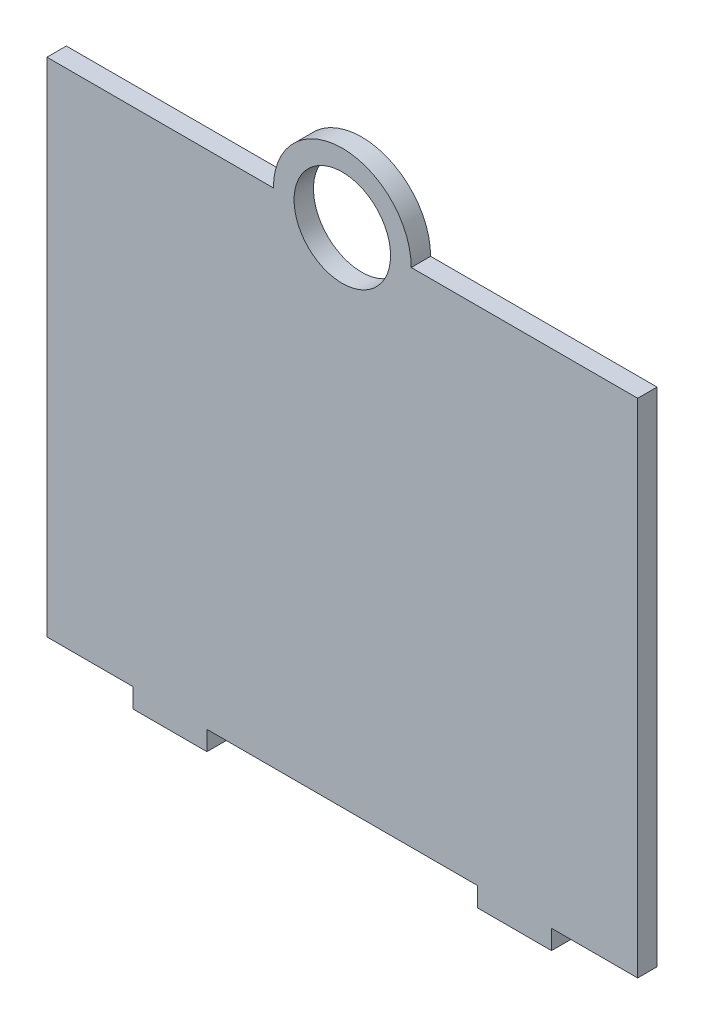
ISO-10303-21;
HEADER;
FILE_DESCRIPTION(('STEP AP214'),'2;1');
FILE_NAME('part.step','',(''),(''),'','','');
FILE_SCHEMA(('AUTOMOTIVE_DESIGN { 1 0 10303 214 1 1 1 1 }'));
ENDSEC;
DATA;
#1=APPLICATION_CONTEXT('core data for automotive mechanical design processes');
#2=APPLICATION_PROTOCOL_DEFINITION('international standard','automotive_design',2000,#1);
#3=PRODUCT_CONTEXT('',#1,'mechanical');
#4=PRODUCT('Part','Part','',(#3));
#5=PRODUCT_RELATED_PRODUCT_CATEGORY('part','',(#4));
#6=PRODUCT_DEFINITION_FORMATION('','',#4);
#7=PRODUCT_DEFINITION_CONTEXT('part definition',#1,'design');
#8=PRODUCT_DEFINITION('design','',#6,#7);
#9=PRODUCT_DEFINITION_SHAPE('','',#8);
#10=(LENGTH_UNIT() NAMED_UNIT(*) SI_UNIT(.MILLI.,.METRE.));
#11=(NAMED_UNIT(*) PLANE_ANGLE_UNIT() SI_UNIT($,.RADIAN.));
#12=(NAMED_UNIT(*) SI_UNIT($,.STERADIAN.) SOLID_ANGLE_UNIT());
#13=UNCERTAINTY_MEASURE_WITH_UNIT(LENGTH_MEASURE(1.E-05),#10,'distance_accuracy_value','');
#14=(GEOMETRIC_REPRESENTATION_CONTEXT(3) GLOBAL_UNCERTAINTY_ASSIGNED_CONTEXT((#13)) GLOBAL_UNIT_ASSIGNED_CONTEXT((#10,
#11,#12)) REPRESENTATION_CONTEXT('',''));
#15=CARTESIAN_POINT('',(0.,0.,0.));
#16=DIRECTION('',(0.,0.,1.));
#17=DIRECTION('',(1.,0.,0.));
#18=AXIS2_PLACEMENT_3D('',#15,#16,#17);
#19=CARTESIAN_POINT('',(0.,142.24,0.));
#20=DIRECTION('',(0.,0.,1.));
#21=DIRECTION('',(1.,0.,0.));
#22=AXIS2_PLACEMENT_3D('',#19,#20,#21);
#23=PLANE('',#22);
#24=CARTESIAN_POINT('',(0.,142.24,0.));
#25=DIRECTION('',(0.,0.,1.));
#26=DIRECTION('',(1.,0.,0.));
#27=AXIS2_PLACEMENT_3D('',#24,#25,#26);
#28=CIRCLE('',#27,12.446);
#29=CARTESIAN_POINT('',(12.446,142.24,0.));
#30=VERTEX_POINT('',#29);
#31=EDGE_CURVE('E19',#30,#30,#28,.F.);
#32=ORIENTED_EDGE('',*,*,#31,.T.);
#33=EDGE_LOOP('',(#32));
#34=FACE_BOUND('',#33,.T.);
#35=DIRECTION('',(1.,0.,0.));
#36=VECTOR('',#35,1.);
#37=CARTESIAN_POINT('',(-34.925,12.7,0.));
#38=LINE('',#37,#36);
#39=CARTESIAN_POINT('',(34.925,12.7,0.));
#40=VERTEX_POINT('',#39);
#41=CARTESIAN_POINT('',(-34.925,12.7,0.));
#42=VERTEX_POINT('',#41);
#43=EDGE_CURVE('E458',#40,#42,#38,.F.);
#44=ORIENTED_EDGE('',*,*,#43,.F.);
#45=DIRECTION('',(0.,1.,0.));
#46=VECTOR('',#45,1.);
#47=CARTESIAN_POINT('',(34.925,0.,0.));
#48=LINE('',#47,#46);
#49=CARTESIAN_POINT('',(34.925,7.6999999999999,0.));
#50=VERTEX_POINT('',#49);
#51=EDGE_CURVE('E454',#50,#40,#48,.T.);
#52=ORIENTED_EDGE('',*,*,#51,.F.);
#53=DIRECTION('',(1.,0.,0.));
#54=VECTOR('',#53,1.);
#55=CARTESIAN_POINT('',(-53.975,7.6999999999999,0.));
#56=LINE('',#55,#54);
#57=CARTESIAN_POINT('',(53.975,7.6999999999999,0.));
#58=VERTEX_POINT('',#57);
#59=EDGE_CURVE('E441',#50,#58,#56,.T.);
#60=ORIENTED_EDGE('',*,*,#59,.T.);
#61=DIRECTION('',(0.,1.,0.));
#62=VECTOR('',#61,1.);
#63=CARTESIAN_POINT('',(53.975,0.,0.));
#64=LINE('',#63,#62);
#65=CARTESIAN_POINT('',(53.975,12.7,0.));
#66=VERTEX_POINT('',#65);
#67=EDGE_CURVE('E168',#66,#58,#64,.F.);
#68=ORIENTED_EDGE('',*,*,#67,.F.);
#69=DIRECTION('',(1.,0.,0.));
#70=VECTOR('',#69,1.);
#71=CARTESIAN_POINT('',(53.975,12.7,0.));
#72=LINE('',#71,#70);
#73=CARTESIAN_POINT('',(76.2,12.7,0.));
#74=VERTEX_POINT('',#73);
#75=EDGE_CURVE('E173',#74,#66,#72,.F.);
#76=ORIENTED_EDGE('',*,*,#75,.F.);
#77=DIRECTION('',(0.,1.,0.));
#78=VECTOR('',#77,1.);
#79=CARTESIAN_POINT('',(76.2000000000016,142.24,0.));
#80=LINE('',#79,#78);
#81=CARTESIAN_POINT('',(76.2000000000016,142.24,0.));
#82=VERTEX_POINT('',#81);
#83=EDGE_CURVE('E133',#82,#74,#80,.F.);
#84=ORIENTED_EDGE('',*,*,#83,.F.);
#85=DIRECTION('',(1.,0.,0.));
#86=VECTOR('',#85,1.);
#87=CARTESIAN_POINT('',(17.7800000000008,142.24,0.));
#88=LINE('',#87,#86);
#89=CARTESIAN_POINT('',(17.7800000000008,142.24,0.));
#90=VERTEX_POINT('',#89);
#91=EDGE_CURVE('E130',#90,#82,#88,.T.);
#92=ORIENTED_EDGE('',*,*,#91,.F.);
#93=CARTESIAN_POINT('',(0.,142.24,0.));
#94=DIRECTION('',(0.,0.,1.));
#95=DIRECTION('',(1.,0.,0.));
#96=AXIS2_PLACEMENT_3D('',#93,#94,#95);
#97=CIRCLE('',#96,17.7800000000008);
#98=CARTESIAN_POINT('',(-17.7800000000008,142.24,0.));
#99=VERTEX_POINT('',#98);
#100=EDGE_CURVE('E119',#99,#90,#97,.F.);
#101=ORIENTED_EDGE('',*,*,#100,.F.);
#102=DIRECTION('',(1.,0.,0.));
#103=VECTOR('',#102,1.);
#104=CARTESIAN_POINT('',(-76.2000000000008,142.24,0.));
#105=LINE('',#104,#103);
#106=CARTESIAN_POINT('',(-76.2000000000008,142.24,0.));
#107=VERTEX_POINT('',#106);
#108=EDGE_CURVE('E114',#107,#99,#105,.T.);
#109=ORIENTED_EDGE('',*,*,#108,.F.);
#110=DIRECTION('',(0.,-1.,0.));
#111=VECTOR('',#110,1.);
#112=CARTESIAN_POINT('',(-76.2000000000008,142.24,0.));
#113=LINE('',#112,#111);
#114=CARTESIAN_POINT('',(-76.2,12.7,0.));
#115=VERTEX_POINT('',#114);
#116=EDGE_CURVE('E182',#115,#107,#113,.F.);
#117=ORIENTED_EDGE('',*,*,#116,.F.);
#118=DIRECTION('',(1.,0.,0.));
#119=VECTOR('',#118,1.);
#120=CARTESIAN_POINT('',(-76.2,12.7,0.));
#121=LINE('',#120,#119);
#122=CARTESIAN_POINT('',(-53.975,12.7,0.));
#123=VERTEX_POINT('',#122);
#124=EDGE_CURVE('E187',#123,#115,#121,.F.);
#125=ORIENTED_EDGE('',*,*,#124,.F.);
#126=DIRECTION('',(0.,1.,0.));
#127=VECTOR('',#126,1.);
#128=CARTESIAN_POINT('',(-53.975,0.,0.));
#129=LINE('',#128,#127);
#130=CARTESIAN_POINT('',(-53.975,7.6999999999999,0.));
#131=VERTEX_POINT('',#130);
#132=EDGE_CURVE('E193',#131,#123,#129,.T.);
#133=ORIENTED_EDGE('',*,*,#132,.F.);
#134=DIRECTION('',(1.,0.,0.));
#135=VECTOR('',#134,1.);
#136=CARTESIAN_POINT('',(-53.975,7.6999999999999,0.));
#137=LINE('',#136,#135);
#138=CARTESIAN_POINT('',(-34.925,7.6999999999999,0.));
#139=VERTEX_POINT('',#138);
#140=EDGE_CURVE('E465',#131,#139,#137,.T.);
#141=ORIENTED_EDGE('',*,*,#140,.T.);
#142=DIRECTION('',(0.,1.,0.));
#143=VECTOR('',#142,1.);
#144=CARTESIAN_POINT('',(-34.925,0.,0.));
#145=LINE('',#144,#143);
#146=EDGE_CURVE('E460',#42,#139,#145,.F.);
#147=ORIENTED_EDGE('',*,*,#146,.F.);
#148=EDGE_LOOP('',(#44,#52,#60,#68,#76,#84,#92,#101,#109,#117,#125,#133,#141,#147));
#149=FACE_BOUND('',#148,.T.);
#150=ADVANCED_FACE('F16',(#34,#149),#23,.T.);
#151=CARTESIAN_POINT('',(0.,142.24,-5.));
#152=DIRECTION('',(0.,0.,1.));
#153=DIRECTION('',(1.,0.,0.));
#154=AXIS2_PLACEMENT_3D('',#151,#152,#153);
#155=CYLINDRICAL_SURFACE('',#154,12.446);
#156=CARTESIAN_POINT('',(0.,142.24,-5.));
#157=DIRECTION('',(0.,0.,1.));
#158=DIRECTION('',(1.,0.,0.));
#159=AXIS2_PLACEMENT_3D('',#156,#157,#158);
#160=CIRCLE('',#159,12.446);
#161=CARTESIAN_POINT('',(12.446,142.24,-5.));
#162=VERTEX_POINT('',#161);
#163=EDGE_CURVE('E162',#162,#162,#160,.F.);
#164=ORIENTED_EDGE('',*,*,#163,.T.);
#165=EDGE_LOOP('',(#164));
#166=FACE_BOUND('',#165,.T.);
#167=ORIENTED_EDGE('',*,*,#31,.F.);
#168=EDGE_LOOP('',(#167));
#169=FACE_BOUND('',#168,.T.);
#170=ADVANCED_FACE('F207',(#166,#169),#155,.F.);
#171=CARTESIAN_POINT('',(53.975,12.7,-5.));
#172=DIRECTION('',(0.,-1.,0.));
#173=DIRECTION('',(0.,0.,-1.));
#174=AXIS2_PLACEMENT_3D('',#171,#172,#173);
#175=PLANE('',#174);
#176=DIRECTION('',(1.,0.,0.));
#177=VECTOR('',#176,1.);
#178=CARTESIAN_POINT('',(0.,12.7,-5.));
#179=LINE('',#178,#177);
#180=CARTESIAN_POINT('',(53.9750000000008,12.7,-5.));
#181=VERTEX_POINT('',#180);
#182=CARTESIAN_POINT('',(76.2,12.7,-5.));
#183=VERTEX_POINT('',#182);
#184=EDGE_CURVE('E154',#181,#183,#179,.T.);
#185=ORIENTED_EDGE('',*,*,#184,.T.);
#186=DIRECTION('',(0.,0.,1.));
#187=VECTOR('',#186,1.);
#188=CARTESIAN_POINT('',(76.2,12.7,-5.));
#189=LINE('',#188,#187);
#190=EDGE_CURVE('E136',#74,#183,#189,.F.);
#191=ORIENTED_EDGE('',*,*,#190,.F.);
#192=ORIENTED_EDGE('',*,*,#75,.T.);
#193=DIRECTION('',(0.,0.,-1.));
#194=VECTOR('',#193,1.);
#195=CARTESIAN_POINT('',(53.975,12.7,-5.));
#196=LINE('',#195,#194);
#197=EDGE_CURVE('E165',#181,#66,#196,.F.);
#198=ORIENTED_EDGE('',*,*,#197,.F.);
#199=EDGE_LOOP('',(#185,#191,#192,#198));
#200=FACE_BOUND('',#199,.T.);
#201=ADVANCED_FACE('F265',(#200),#175,.T.);
#202=CARTESIAN_POINT('',(76.2000000000016,142.24,-5.));
#203=DIRECTION('',(1.,0.,0.));
#204=DIRECTION('',(0.,1.,0.));
#205=AXIS2_PLACEMENT_3D('',#202,#203,#204);
#206=PLANE('',#205);
#207=DIRECTION('',(0.,1.,0.));
#208=VECTOR('',#207,1.);
#209=CARTESIAN_POINT('',(76.2,142.24,-5.));
#210=LINE('',#209,#208);
#211=CARTESIAN_POINT('',(76.2000000000006,142.24,-5.));
#212=VERTEX_POINT('',#211);
#213=EDGE_CURVE('E151',#183,#212,#210,.T.);
#214=ORIENTED_EDGE('',*,*,#213,.T.);
#215=DIRECTION('',(0.,0.,1.));
#216=VECTOR('',#215,1.);
#217=CARTESIAN_POINT('',(76.2000000000016,142.24,-5.));
#218=LINE('',#217,#216);
#219=EDGE_CURVE('E128',#82,#212,#218,.F.);
#220=ORIENTED_EDGE('',*,*,#219,.F.);
#221=ORIENTED_EDGE('',*,*,#83,.T.);
#222=ORIENTED_EDGE('',*,*,#190,.T.);
#223=EDGE_LOOP('',(#214,#220,#221,#222));
#224=FACE_BOUND('',#223,.T.);
#225=ADVANCED_FACE('F262',(#224),#206,.T.);
#226=CARTESIAN_POINT('',(17.7800000000008,142.24,-5.));
#227=DIRECTION('',(0.,1.,0.));
#228=DIRECTION('',(0.,0.,1.));
#229=AXIS2_PLACEMENT_3D('',#226,#227,#228);
#230=PLANE('',#229);
#231=DIRECTION('',(1.,0.,0.));
#232=VECTOR('',#231,1.);
#233=CARTESIAN_POINT('',(0.,142.24,-5.));
#234=LINE('',#233,#232);
#235=CARTESIAN_POINT('',(17.7800000000008,142.24,-5.));
#236=VERTEX_POINT('',#235);
#237=EDGE_CURVE('E141',#212,#236,#234,.F.);
#238=ORIENTED_EDGE('',*,*,#237,.T.);
#239=DIRECTION('',(0.,0.,1.));
#240=VECTOR('',#239,1.);
#241=CARTESIAN_POINT('',(17.7800000000008,142.24,-5.));
#242=LINE('',#241,#240);
#243=EDGE_CURVE('E124',#90,#236,#242,.F.);
#244=ORIENTED_EDGE('',*,*,#243,.F.);
#245=ORIENTED_EDGE('',*,*,#91,.T.);
#246=ORIENTED_EDGE('',*,*,#219,.T.);
#247=EDGE_LOOP('',(#238,#244,#245,#246));
#248=FACE_BOUND('',#247,.T.);
#249=ADVANCED_FACE('F139',(#248),#230,.T.);
#250=CARTESIAN_POINT('',(0.,142.24,-5.));
#251=DIRECTION('',(0.,0.,1.));
#252=DIRECTION('',(1.,0.,0.));
#253=AXIS2_PLACEMENT_3D('',#250,#251,#252);
#254=CYLINDRICAL_SURFACE('',#253,17.7800000000008);
#255=CARTESIAN_POINT('',(0.,142.24,-5.));
#256=DIRECTION('',(0.,0.,1.));
#257=DIRECTION('',(1.,0.,0.));
#258=AXIS2_PLACEMENT_3D('',#255,#256,#257);
#259=CIRCLE('',#258,17.7800000000008);
#260=CARTESIAN_POINT('',(-17.7800000000008,142.24,-5.));
#261=VERTEX_POINT('',#260);
#262=EDGE_CURVE('E201',#236,#261,#259,.T.);
#263=ORIENTED_EDGE('',*,*,#262,.T.);
#264=DIRECTION('',(0.,0.,1.));
#265=VECTOR('',#264,1.);
#266=CARTESIAN_POINT('',(-17.7800000000008,142.24,-5.));
#267=LINE('',#266,#265);
#268=EDGE_CURVE('E126',#99,#261,#267,.F.);
#269=ORIENTED_EDGE('',*,*,#268,.F.);
#270=ORIENTED_EDGE('',*,*,#100,.T.);
#271=ORIENTED_EDGE('',*,*,#243,.T.);
#272=EDGE_LOOP('',(#263,#269,#270,#271));
#273=FACE_BOUND('',#272,.T.);
#274=ADVANCED_FACE('F122',(#273),#254,.T.);
#275=CARTESIAN_POINT('',(-76.2000000000008,142.24,-5.));
#276=DIRECTION('',(0.,1.,0.));
#277=DIRECTION('',(0.,0.,1.));
#278=AXIS2_PLACEMENT_3D('',#275,#276,#277);
#279=PLANE('',#278);
#280=DIRECTION('',(1.,0.,0.));
#281=VECTOR('',#280,1.);
#282=CARTESIAN_POINT('',(0.,142.24,-5.));
#283=LINE('',#282,#281);
#284=CARTESIAN_POINT('',(-76.2000000000008,142.24,-5.));
#285=VERTEX_POINT('',#284);
#286=EDGE_CURVE('E203',#261,#285,#283,.F.);
#287=ORIENTED_EDGE('',*,*,#286,.T.);
#288=DIRECTION('',(0.,0.,1.));
#289=VECTOR('',#288,1.);
#290=CARTESIAN_POINT('',(-76.2000000000008,142.24,-5.));
#291=LINE('',#290,#289);
#292=EDGE_CURVE('E184',#107,#285,#291,.F.);
#293=ORIENTED_EDGE('',*,*,#292,.F.);
#294=ORIENTED_EDGE('',*,*,#108,.T.);
#295=ORIENTED_EDGE('',*,*,#268,.T.);
#296=EDGE_LOOP('',(#287,#293,#294,#295));
#297=FACE_BOUND('',#296,.T.);
#298=ADVANCED_FACE('F254',(#297),#279,.T.);
#299=CARTESIAN_POINT('',(-76.2000000000008,142.24,-5.));
#300=DIRECTION('',(-1.,0.,0.));
#301=DIRECTION('',(0.,-1.,0.));
#302=AXIS2_PLACEMENT_3D('',#299,#300,#301);
#303=PLANE('',#302);
#304=DIRECTION('',(0.,1.,0.));
#305=VECTOR('',#304,1.);
#306=CARTESIAN_POINT('',(-76.2000000000008,142.24,-5.));
#307=LINE('',#306,#305);
#308=CARTESIAN_POINT('',(-76.2000000000002,12.7,-5.));
#309=VERTEX_POINT('',#308);
#310=EDGE_CURVE('E474',#285,#309,#307,.F.);
#311=ORIENTED_EDGE('',*,*,#310,.T.);
#312=DIRECTION('',(0.,0.,-1.));
#313=VECTOR('',#312,1.);
#314=CARTESIAN_POINT('',(-76.2,12.7,-5.));
#315=LINE('',#314,#313);
#316=EDGE_CURVE('E189',#115,#309,#315,.T.);
#317=ORIENTED_EDGE('',*,*,#316,.F.);
#318=ORIENTED_EDGE('',*,*,#116,.T.);
#319=ORIENTED_EDGE('',*,*,#292,.T.);
#320=EDGE_LOOP('',(#311,#317,#318,#319));
#321=FACE_BOUND('',#320,.T.);
#322=ADVANCED_FACE('F250',(#321),#303,.T.);
#323=CARTESIAN_POINT('',(-76.2,12.7,-5.));
#324=DIRECTION('',(0.,-1.,0.));
#325=DIRECTION('',(0.,0.,-1.));
#326=AXIS2_PLACEMENT_3D('',#323,#324,#325);
#327=PLANE('',#326);
#328=DIRECTION('',(1.,0.,0.));
#329=VECTOR('',#328,1.);
#330=CARTESIAN_POINT('',(0.,12.7,-5.));
#331=LINE('',#330,#329);
#332=CARTESIAN_POINT('',(-53.975,12.7,-5.));
#333=VERTEX_POINT('',#332);
#334=EDGE_CURVE('E477',#309,#333,#331,.T.);
#335=ORIENTED_EDGE('',*,*,#334,.T.);
#336=DIRECTION('',(0.,0.,1.));
#337=VECTOR('',#336,1.);
#338=CARTESIAN_POINT('',(-53.975,12.7,-5.));
#339=LINE('',#338,#337);
#340=EDGE_CURVE('E470',#123,#333,#339,.F.);
#341=ORIENTED_EDGE('',*,*,#340,.F.);
#342=ORIENTED_EDGE('',*,*,#124,.T.);
#343=ORIENTED_EDGE('',*,*,#316,.T.);
#344=EDGE_LOOP('',(#335,#341,#342,#343));
#345=FACE_BOUND('',#344,.T.);
#346=ADVANCED_FACE('F246',(#345),#327,.T.);
#347=CARTESIAN_POINT('',(-53.975,0.,-5.));
#348=DIRECTION('',(-1.,0.,0.));
#349=DIRECTION('',(0.,0.,1.));
#350=AXIS2_PLACEMENT_3D('',#347,#348,#349);
#351=PLANE('',#350);
#352=ORIENTED_EDGE('',*,*,#340,.T.);
#353=DIRECTION('',(0.,1.,0.));
#354=VECTOR('',#353,1.);
#355=CARTESIAN_POINT('',(-53.975,142.24,-5.));
#356=LINE('',#355,#354);
#357=CARTESIAN_POINT('',(-53.975,7.6999999999999,-5.));
#358=VERTEX_POINT('',#357);
#359=EDGE_CURVE('E492',#333,#358,#356,.F.);
#360=ORIENTED_EDGE('',*,*,#359,.T.);
#361=DIRECTION('',(0.,0.,1.));
#362=VECTOR('',#361,1.);
#363=CARTESIAN_POINT('',(-53.975,7.6999999999999,-5.));
#364=LINE('',#363,#362);
#365=EDGE_CURVE('E467',#358,#131,#364,.T.);
#366=ORIENTED_EDGE('',*,*,#365,.T.);
#367=ORIENTED_EDGE('',*,*,#132,.T.);
#368=EDGE_LOOP('',(#352,#360,#366,#367));
#369=FACE_BOUND('',#368,.T.);
#370=ADVANCED_FACE('F242',(#369),#351,.T.);
#371=CARTESIAN_POINT('',(-53.975,7.6999999999999,-5.));
#372=DIRECTION('',(0.,1.,0.));
#373=DIRECTION('',(0.,0.,1.));
#374=AXIS2_PLACEMENT_3D('',#371,#372,#373);
#375=PLANE('',#374);
#376=ORIENTED_EDGE('',*,*,#140,.F.);
#377=ORIENTED_EDGE('',*,*,#365,.F.);
#378=DIRECTION('',(1.,0.,0.));
#379=VECTOR('',#378,1.);
#380=CARTESIAN_POINT('',(0.,7.6999999999999,-5.));
#381=LINE('',#380,#379);
#382=CARTESIAN_POINT('',(-34.925,7.6999999999999,-5.));
#383=VERTEX_POINT('',#382);
#384=EDGE_CURVE('E495',#358,#383,#381,.T.);
#385=ORIENTED_EDGE('',*,*,#384,.T.);
#386=DIRECTION('',(0.,0.,-1.));
#387=VECTOR('',#386,1.);
#388=CARTESIAN_POINT('',(-34.925,7.6999999999999,-5.));
#389=LINE('',#388,#387);
#390=EDGE_CURVE('E463',#139,#383,#389,.T.);
#391=ORIENTED_EDGE('',*,*,#390,.F.);
#392=EDGE_LOOP('',(#376,#377,#385,#391));
#393=FACE_BOUND('',#392,.T.);
#394=ADVANCED_FACE('F238',(#393),#375,.F.);
#395=CARTESIAN_POINT('',(-34.925,0.,-5.));
#396=DIRECTION('',(1.,0.,0.));
#397=DIRECTION('',(0.,0.,-1.));
#398=AXIS2_PLACEMENT_3D('',#395,#396,#397);
#399=PLANE('',#398);
#400=DIRECTION('',(0.,0.,-1.));
#401=VECTOR('',#400,1.);
#402=CARTESIAN_POINT('',(-34.925,12.7,-5.));
#403=LINE('',#402,#401);
#404=CARTESIAN_POINT('',(-34.925,12.7,-5.));
#405=VERTEX_POINT('',#404);
#406=EDGE_CURVE('E456',#42,#405,#403,.T.);
#407=ORIENTED_EDGE('',*,*,#406,.F.);
#408=ORIENTED_EDGE('',*,*,#146,.T.);
#409=ORIENTED_EDGE('',*,*,#390,.T.);
#410=DIRECTION('',(0.,1.,0.));
#411=VECTOR('',#410,1.);
#412=CARTESIAN_POINT('',(-34.925,142.24,-5.));
#413=LINE('',#412,#411);
#414=EDGE_CURVE('E498',#383,#405,#413,.T.);
#415=ORIENTED_EDGE('',*,*,#414,.T.);
#416=EDGE_LOOP('',(#407,#408,#409,#415));
#417=FACE_BOUND('',#416,.T.);
#418=ADVANCED_FACE('F234',(#417),#399,.T.);
#419=CARTESIAN_POINT('',(-34.925,12.7,-5.));
#420=DIRECTION('',(0.,-1.,0.));
#421=DIRECTION('',(0.,0.,-1.));
#422=AXIS2_PLACEMENT_3D('',#419,#420,#421);
#423=PLANE('',#422);
#424=DIRECTION('',(1.,0.,0.));
#425=VECTOR('',#424,1.);
#426=CARTESIAN_POINT('',(0.,12.7,-5.));
#427=LINE('',#426,#425);
#428=CARTESIAN_POINT('',(34.925,12.7,-5.));
#429=VERTEX_POINT('',#428);
#430=EDGE_CURVE('E501',#405,#429,#427,.T.);
#431=ORIENTED_EDGE('',*,*,#430,.T.);
#432=DIRECTION('',(0.,0.,1.));
#433=VECTOR('',#432,1.);
#434=CARTESIAN_POINT('',(34.925,12.7,-5.));
#435=LINE('',#434,#433);
#436=EDGE_CURVE('E452',#40,#429,#435,.F.);
#437=ORIENTED_EDGE('',*,*,#436,.F.);
#438=ORIENTED_EDGE('',*,*,#43,.T.);
#439=ORIENTED_EDGE('',*,*,#406,.T.);
#440=EDGE_LOOP('',(#431,#437,#438,#439));
#441=FACE_BOUND('',#440,.T.);
#442=ADVANCED_FACE('F230',(#441),#423,.T.);
#443=CARTESIAN_POINT('',(34.925,0.,-5.));
#444=DIRECTION('',(-1.,0.,0.));
#445=DIRECTION('',(0.,0.,1.));
#446=AXIS2_PLACEMENT_3D('',#443,#444,#445);
#447=PLANE('',#446);
#448=ORIENTED_EDGE('',*,*,#436,.T.);
#449=DIRECTION('',(0.,1.,0.));
#450=VECTOR('',#449,1.);
#451=CARTESIAN_POINT('',(34.925,142.24,-5.));
#452=LINE('',#451,#450);
#453=CARTESIAN_POINT('',(34.925,7.6999999999999,-5.));
#454=VERTEX_POINT('',#453);
#455=EDGE_CURVE('E504',#429,#454,#452,.F.);
#456=ORIENTED_EDGE('',*,*,#455,.T.);
#457=DIRECTION('',(0.,0.,1.));
#458=VECTOR('',#457,1.);
#459=CARTESIAN_POINT('',(34.925,7.6999999999999,-5.));
#460=LINE('',#459,#458);
#461=EDGE_CURVE('E443',#454,#50,#460,.T.);
#462=ORIENTED_EDGE('',*,*,#461,.T.);
#463=ORIENTED_EDGE('',*,*,#51,.T.);
#464=EDGE_LOOP('',(#448,#456,#462,#463));
#465=FACE_BOUND('',#464,.T.);
#466=ADVANCED_FACE('F226',(#465),#447,.T.);
#467=CARTESIAN_POINT('',(-53.975,7.6999999999999,-5.));
#468=DIRECTION('',(0.,1.,0.));
#469=DIRECTION('',(0.,0.,1.));
#470=AXIS2_PLACEMENT_3D('',#467,#468,#469);
#471=PLANE('',#470);
#472=DIRECTION('',(1.,0.,0.));
#473=VECTOR('',#472,1.);
#474=CARTESIAN_POINT('',(0.,7.6999999999999,-5.));
#475=LINE('',#474,#473);
#476=CARTESIAN_POINT('',(53.9750000000004,7.6999999999999,-5.));
#477=VERTEX_POINT('',#476);
#478=EDGE_CURVE('E25',#454,#477,#475,.T.);
#479=ORIENTED_EDGE('',*,*,#478,.T.);
#480=DIRECTION('',(0.,0.,-1.));
#481=VECTOR('',#480,1.);
#482=CARTESIAN_POINT('',(53.975,7.6999999999999,-5.));
#483=LINE('',#482,#481);
#484=EDGE_CURVE('E33',#58,#477,#483,.T.);
#485=ORIENTED_EDGE('',*,*,#484,.F.);
#486=ORIENTED_EDGE('',*,*,#59,.F.);
#487=ORIENTED_EDGE('',*,*,#461,.F.);
#488=EDGE_LOOP('',(#479,#485,#486,#487));
#489=FACE_BOUND('',#488,.T.);
#490=ADVANCED_FACE('F220',(#489),#471,.F.);
#491=CARTESIAN_POINT('',(53.975,0.,-5.));
#492=DIRECTION('',(1.,0.,0.));
#493=DIRECTION('',(0.,0.,-1.));
#494=AXIS2_PLACEMENT_3D('',#491,#492,#493);
#495=PLANE('',#494);
#496=ORIENTED_EDGE('',*,*,#197,.T.);
#497=ORIENTED_EDGE('',*,*,#67,.T.);
#498=ORIENTED_EDGE('',*,*,#484,.T.);
#499=DIRECTION('',(0.,1.,0.));
#500=VECTOR('',#499,1.);
#501=CARTESIAN_POINT('',(53.9750000000016,142.24,-5.));
#502=LINE('',#501,#500);
#503=EDGE_CURVE('E11',#477,#181,#502,.T.);
#504=ORIENTED_EDGE('',*,*,#503,.T.);
#505=EDGE_LOOP('',(#496,#497,#498,#504));
#506=FACE_BOUND('',#505,.T.);
#507=ADVANCED_FACE('F212',(#506),#495,.T.);
#508=CARTESIAN_POINT('',(0.,142.24,-5.));
#509=DIRECTION('',(0.,0.,1.));
#510=DIRECTION('',(1.,0.,0.));
#511=AXIS2_PLACEMENT_3D('',#508,#509,#510);
#512=PLANE('',#511);
#513=ORIENTED_EDGE('',*,*,#478,.F.);
#514=ORIENTED_EDGE('',*,*,#455,.F.);
#515=ORIENTED_EDGE('',*,*,#430,.F.);
#516=ORIENTED_EDGE('',*,*,#414,.F.);
#517=ORIENTED_EDGE('',*,*,#384,.F.);
#518=ORIENTED_EDGE('',*,*,#359,.F.);
#519=ORIENTED_EDGE('',*,*,#334,.F.);
#520=ORIENTED_EDGE('',*,*,#310,.F.);
#521=ORIENTED_EDGE('',*,*,#286,.F.);
#522=ORIENTED_EDGE('',*,*,#262,.F.);
#523=ORIENTED_EDGE('',*,*,#237,.F.);
#524=ORIENTED_EDGE('',*,*,#213,.F.);
#525=ORIENTED_EDGE('',*,*,#184,.F.);
#526=ORIENTED_EDGE('',*,*,#503,.F.);
#527=EDGE_LOOP('',(#513,#514,#515,#516,#517,#518,#519,#520,#521,#522,#523,#524,#525,#526));
#528=FACE_BOUND('',#527,.T.);
#529=ORIENTED_EDGE('',*,*,#163,.F.);
#530=EDGE_LOOP('',(#529));
#531=FACE_BOUND('',#530,.T.);
#532=ADVANCED_FACE('F210',(#528,#531),#512,.F.);
#533=CLOSED_SHELL('',(#150,#170,#201,#225,#249,#274,#298,#322,#346,#370,#394,#418,#442,#466,
#490,#507,#532));
#534=MANIFOLD_SOLID_BREP('B1',#533);
#535=ADVANCED_BREP_SHAPE_REPRESENTATION('',(#18,#534),#14);
#536=SHAPE_DEFINITION_REPRESENTATION(#9,#535);
ENDSEC;
END-ISO-10303-21;
